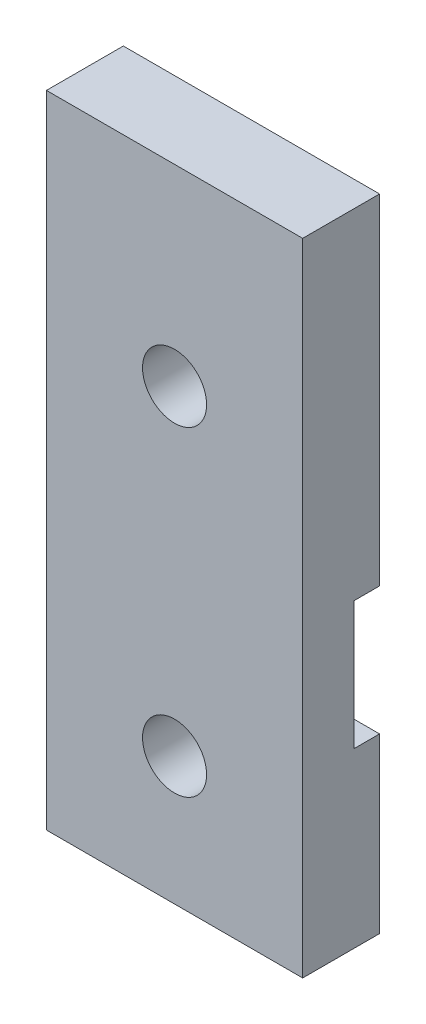
ISO-10303-21;
HEADER;
FILE_DESCRIPTION(('STEP AP214'),'2;1');
FILE_NAME('part.step','',(''),(''),'','','');
FILE_SCHEMA(('AUTOMOTIVE_DESIGN { 1 0 10303 214 1 1 1 1 }'));
ENDSEC;
DATA;
#1=APPLICATION_CONTEXT('core data for automotive mechanical design processes');
#2=APPLICATION_PROTOCOL_DEFINITION('international standard','automotive_design',2000,#1);
#3=PRODUCT_CONTEXT('',#1,'mechanical');
#4=PRODUCT('Part','Part','',(#3));
#5=PRODUCT_RELATED_PRODUCT_CATEGORY('part','',(#4));
#6=PRODUCT_DEFINITION_FORMATION('','',#4);
#7=PRODUCT_DEFINITION_CONTEXT('part definition',#1,'design');
#8=PRODUCT_DEFINITION('design','',#6,#7);
#9=PRODUCT_DEFINITION_SHAPE('','',#8);
#10=(LENGTH_UNIT() NAMED_UNIT(*) SI_UNIT(.MILLI.,.METRE.));
#11=(NAMED_UNIT(*) PLANE_ANGLE_UNIT() SI_UNIT($,.RADIAN.));
#12=(NAMED_UNIT(*) SI_UNIT($,.STERADIAN.) SOLID_ANGLE_UNIT());
#13=UNCERTAINTY_MEASURE_WITH_UNIT(LENGTH_MEASURE(1.E-05),#10,'distance_accuracy_value','');
#14=(GEOMETRIC_REPRESENTATION_CONTEXT(3) GLOBAL_UNCERTAINTY_ASSIGNED_CONTEXT((#13)) GLOBAL_UNIT_ASSIGNED_CONTEXT((#10,
#11,#12)) REPRESENTATION_CONTEXT('',''));
#15=CARTESIAN_POINT('',(0.,0.,0.));
#16=DIRECTION('',(0.,0.,1.));
#17=DIRECTION('',(1.,0.,0.));
#18=AXIS2_PLACEMENT_3D('',#15,#16,#17);
#19=CARTESIAN_POINT('',(3.25000000000008,18.5,2.));
#20=DIRECTION('',(0.,0.,-1.));
#21=DIRECTION('',(-1.,0.,0.));
#22=AXIS2_PLACEMENT_3D('',#19,#20,#21);
#23=CYLINDRICAL_SURFACE('',#22,5.);
#24=CARTESIAN_POINT('',(3.25000000000008,18.5,2.));
#25=DIRECTION('',(0.,0.,1.));
#26=DIRECTION('',(1.,0.,0.));
#27=AXIS2_PLACEMENT_3D('',#24,#25,#26);
#28=CIRCLE('',#27,5.);
#29=CARTESIAN_POINT('',(3.25000000000008,13.5,2.));
#30=VERTEX_POINT('',#29);
#31=CARTESIAN_POINT('',(3.25000000000008,23.5,2.));
#32=VERTEX_POINT('',#31);
#33=EDGE_CURVE('E142',#30,#32,#28,.T.);
#34=ORIENTED_EDGE('',*,*,#33,.T.);
#35=DIRECTION('',(0.,0.,-1.));
#36=VECTOR('',#35,1.);
#37=CARTESIAN_POINT('',(3.25000000000008,23.5,2.));
#38=LINE('',#37,#36);
#39=CARTESIAN_POINT('',(3.25000000000008,23.5,0.));
#40=VERTEX_POINT('',#39);
#41=EDGE_CURVE('E158',#32,#40,#38,.T.);
#42=ORIENTED_EDGE('',*,*,#41,.T.);
#43=CARTESIAN_POINT('',(3.25000000000008,18.5,0.));
#44=DIRECTION('',(0.,0.,1.));
#45=DIRECTION('',(1.,0.,0.));
#46=AXIS2_PLACEMENT_3D('',#43,#44,#45);
#47=CIRCLE('',#46,5.);
#48=CARTESIAN_POINT('',(3.25000000000008,13.5,0.));
#49=VERTEX_POINT('',#48);
#50=EDGE_CURVE('E144',#49,#40,#47,.T.);
#51=ORIENTED_EDGE('',*,*,#50,.F.);
#52=DIRECTION('',(0.,0.,-1.));
#53=VECTOR('',#52,1.);
#54=CARTESIAN_POINT('',(3.25000000000008,13.5,2.));
#55=LINE('',#54,#53);
#56=EDGE_CURVE('E132',#30,#49,#55,.T.);
#57=ORIENTED_EDGE('',*,*,#56,.F.);
#58=EDGE_LOOP('',(#34,#42,#51,#57));
#59=FACE_BOUND('',#58,.T.);
#60=ADVANCED_FACE('F39',(#59),#23,.F.);
#61=CARTESIAN_POINT('',(16.7499999999999,18.5,2.));
#62=DIRECTION('',(0.,0.,-1.));
#63=DIRECTION('',(-1.,0.,0.));
#64=AXIS2_PLACEMENT_3D('',#61,#62,#63);
#65=CYLINDRICAL_SURFACE('',#64,5.);
#66=DIRECTION('',(0.,0.,-1.));
#67=VECTOR('',#66,1.);
#68=CARTESIAN_POINT('',(16.7499999999999,23.5,2.));
#69=LINE('',#68,#67);
#70=CARTESIAN_POINT('',(16.7499999999999,23.5,2.));
#71=VERTEX_POINT('',#70);
#72=CARTESIAN_POINT('',(16.7499999999999,23.5,0.));
#73=VERTEX_POINT('',#72);
#74=EDGE_CURVE('E219',#71,#73,#69,.T.);
#75=ORIENTED_EDGE('',*,*,#74,.F.);
#76=CARTESIAN_POINT('',(16.7499999999999,18.5,2.));
#77=DIRECTION('',(0.,0.,1.));
#78=DIRECTION('',(-1.,0.,0.));
#79=AXIS2_PLACEMENT_3D('',#76,#77,#78);
#80=CIRCLE('',#79,5.);
#81=CARTESIAN_POINT('',(16.7499999999999,13.5,2.));
#82=VERTEX_POINT('',#81);
#83=EDGE_CURVE('E151',#71,#82,#80,.T.);
#84=ORIENTED_EDGE('',*,*,#83,.T.);
#85=DIRECTION('',(0.,0.,-1.));
#86=VECTOR('',#85,1.);
#87=CARTESIAN_POINT('',(16.7499999999999,13.5,2.));
#88=LINE('',#87,#86);
#89=CARTESIAN_POINT('',(16.7499999999999,13.5,0.));
#90=VERTEX_POINT('',#89);
#91=EDGE_CURVE('E220',#82,#90,#88,.T.);
#92=ORIENTED_EDGE('',*,*,#91,.T.);
#93=CARTESIAN_POINT('',(16.7499999999999,18.5,0.));
#94=DIRECTION('',(0.,0.,-1.));
#95=DIRECTION('',(-1.,0.,0.));
#96=AXIS2_PLACEMENT_3D('',#93,#94,#95);
#97=CIRCLE('',#96,5.);
#98=EDGE_CURVE('E47',#73,#90,#97,.F.);
#99=ORIENTED_EDGE('',*,*,#98,.F.);
#100=EDGE_LOOP('',(#75,#84,#92,#99));
#101=FACE_BOUND('',#100,.T.);
#102=ADVANCED_FACE('F218',(#101),#65,.F.);
#103=CARTESIAN_POINT('',(0.,0.,6.));
#104=DIRECTION('',(1.,0.,0.));
#105=DIRECTION('',(0.,0.,-1.));
#106=AXIS2_PLACEMENT_3D('',#103,#104,#105);
#107=PLANE('',#106);
#108=DIRECTION('',(0.,-1.,0.));
#109=VECTOR('',#108,1.);
#110=CARTESIAN_POINT('',(0.,0.,0.));
#111=LINE('',#110,#109);
#112=CARTESIAN_POINT('',(0.,50.,0.));
#113=VERTEX_POINT('',#112);
#114=CARTESIAN_POINT('',(0.,23.5,0.));
#115=VERTEX_POINT('',#114);
#116=EDGE_CURVE('E183',#113,#115,#111,.T.);
#117=ORIENTED_EDGE('',*,*,#116,.T.);
#118=DIRECTION('',(0.,0.,-1.));
#119=VECTOR('',#118,1.);
#120=CARTESIAN_POINT('',(0.,23.5,2.));
#121=LINE('',#120,#119);
#122=CARTESIAN_POINT('',(0.,23.5,2.));
#123=VERTEX_POINT('',#122);
#124=EDGE_CURVE('E235',#123,#115,#121,.T.);
#125=ORIENTED_EDGE('',*,*,#124,.F.);
#126=DIRECTION('',(0.,-1.,0.));
#127=VECTOR('',#126,1.);
#128=CARTESIAN_POINT('',(0.,0.,2.));
#129=LINE('',#128,#127);
#130=CARTESIAN_POINT('',(0.,13.5,2.));
#131=VERTEX_POINT('',#130);
#132=EDGE_CURVE('E147',#123,#131,#129,.T.);
#133=ORIENTED_EDGE('',*,*,#132,.T.);
#134=DIRECTION('',(0.,0.,-1.));
#135=VECTOR('',#134,1.);
#136=CARTESIAN_POINT('',(0.,13.5,2.));
#137=LINE('',#136,#135);
#138=CARTESIAN_POINT('',(0.,13.5,0.));
#139=VERTEX_POINT('',#138);
#140=EDGE_CURVE('E135',#131,#139,#137,.T.);
#141=ORIENTED_EDGE('',*,*,#140,.T.);
#142=CARTESIAN_POINT('',(0.,0.,0.));
#143=VERTEX_POINT('',#142);
#144=EDGE_CURVE('E171',#139,#143,#111,.T.);
#145=ORIENTED_EDGE('',*,*,#144,.T.);
#146=DIRECTION('',(0.,0.,-1.));
#147=VECTOR('',#146,1.);
#148=CARTESIAN_POINT('',(0.,0.,6.));
#149=LINE('',#148,#147);
#150=CARTESIAN_POINT('',(0.,0.,6.));
#151=VERTEX_POINT('',#150);
#152=EDGE_CURVE('E201',#151,#143,#149,.T.);
#153=ORIENTED_EDGE('',*,*,#152,.F.);
#154=DIRECTION('',(0.,-1.,0.));
#155=VECTOR('',#154,1.);
#156=CARTESIAN_POINT('',(0.,0.,6.));
#157=LINE('',#156,#155);
#158=CARTESIAN_POINT('',(0.,50.,6.));
#159=VERTEX_POINT('',#158);
#160=EDGE_CURVE('E172',#159,#151,#157,.T.);
#161=ORIENTED_EDGE('',*,*,#160,.F.);
#162=DIRECTION('',(0.,0.,-1.));
#163=VECTOR('',#162,1.);
#164=CARTESIAN_POINT('',(0.,50.,6.));
#165=LINE('',#164,#163);
#166=EDGE_CURVE('E182',#159,#113,#165,.T.);
#167=ORIENTED_EDGE('',*,*,#166,.T.);
#168=EDGE_LOOP('',(#117,#125,#133,#141,#145,#153,#161,#167));
#169=FACE_BOUND('',#168,.T.);
#170=ADVANCED_FACE('F41',(#169),#107,.F.);
#171=CARTESIAN_POINT('',(20.,0.,6.));
#172=DIRECTION('',(-1.,0.,0.));
#173=DIRECTION('',(0.,0.,1.));
#174=AXIS2_PLACEMENT_3D('',#171,#172,#173);
#175=PLANE('',#174);
#176=DIRECTION('',(0.,-1.,0.));
#177=VECTOR('',#176,1.);
#178=CARTESIAN_POINT('',(20.,0.,2.));
#179=LINE('',#178,#177);
#180=CARTESIAN_POINT('',(20.,23.5,2.));
#181=VERTEX_POINT('',#180);
#182=CARTESIAN_POINT('',(20.,13.5,2.));
#183=VERTEX_POINT('',#182);
#184=EDGE_CURVE('E11',#181,#183,#179,.T.);
#185=ORIENTED_EDGE('',*,*,#184,.F.);
#186=DIRECTION('',(0.,0.,-1.));
#187=VECTOR('',#186,1.);
#188=CARTESIAN_POINT('',(20.,23.5,2.));
#189=LINE('',#188,#187);
#190=CARTESIAN_POINT('',(20.,23.5,0.));
#191=VERTEX_POINT('',#190);
#192=EDGE_CURVE('E222',#181,#191,#189,.T.);
#193=ORIENTED_EDGE('',*,*,#192,.T.);
#194=DIRECTION('',(0.,1.,0.));
#195=VECTOR('',#194,1.);
#196=CARTESIAN_POINT('',(20.,0.,0.));
#197=LINE('',#196,#195);
#198=CARTESIAN_POINT('',(20.,50.,0.));
#199=VERTEX_POINT('',#198);
#200=EDGE_CURVE('E188',#191,#199,#197,.T.);
#201=ORIENTED_EDGE('',*,*,#200,.T.);
#202=DIRECTION('',(0.,0.,-1.));
#203=VECTOR('',#202,1.);
#204=CARTESIAN_POINT('',(20.,50.,6.));
#205=LINE('',#204,#203);
#206=CARTESIAN_POINT('',(20.,50.,6.));
#207=VERTEX_POINT('',#206);
#208=EDGE_CURVE('E195',#207,#199,#205,.T.);
#209=ORIENTED_EDGE('',*,*,#208,.F.);
#210=DIRECTION('',(0.,1.,0.));
#211=VECTOR('',#210,1.);
#212=CARTESIAN_POINT('',(20.,0.,6.));
#213=LINE('',#212,#211);
#214=CARTESIAN_POINT('',(20.,0.,6.));
#215=VERTEX_POINT('',#214);
#216=EDGE_CURVE('E178',#215,#207,#213,.T.);
#217=ORIENTED_EDGE('',*,*,#216,.F.);
#218=DIRECTION('',(0.,0.,-1.));
#219=VECTOR('',#218,1.);
#220=CARTESIAN_POINT('',(20.,0.,6.));
#221=LINE('',#220,#219);
#222=CARTESIAN_POINT('',(20.,0.,0.));
#223=VERTEX_POINT('',#222);
#224=EDGE_CURVE('E198',#215,#223,#221,.T.);
#225=ORIENTED_EDGE('',*,*,#224,.T.);
#226=CARTESIAN_POINT('',(20.,13.5,0.));
#227=VERTEX_POINT('',#226);
#228=EDGE_CURVE('E189',#223,#227,#197,.T.);
#229=ORIENTED_EDGE('',*,*,#228,.T.);
#230=DIRECTION('',(0.,0.,-1.));
#231=VECTOR('',#230,1.);
#232=CARTESIAN_POINT('',(20.,13.5,2.));
#233=LINE('',#232,#231);
#234=EDGE_CURVE('E154',#183,#227,#233,.T.);
#235=ORIENTED_EDGE('',*,*,#234,.F.);
#236=EDGE_LOOP('',(#185,#193,#201,#209,#217,#225,#229,#235));
#237=FACE_BOUND('',#236,.T.);
#238=ADVANCED_FACE('F296',(#237),#175,.F.);
#239=CARTESIAN_POINT('',(0.,0.,6.));
#240=DIRECTION('',(0.,1.,0.));
#241=DIRECTION('',(0.,0.,1.));
#242=AXIS2_PLACEMENT_3D('',#239,#240,#241);
#243=PLANE('',#242);
#244=DIRECTION('',(1.,0.,0.));
#245=VECTOR('',#244,1.);
#246=CARTESIAN_POINT('',(0.,0.,0.));
#247=LINE('',#246,#245);
#248=EDGE_CURVE('E186',#143,#223,#247,.T.);
#249=ORIENTED_EDGE('',*,*,#248,.T.);
#250=ORIENTED_EDGE('',*,*,#224,.F.);
#251=DIRECTION('',(1.,0.,0.));
#252=VECTOR('',#251,1.);
#253=CARTESIAN_POINT('',(0.,0.,6.));
#254=LINE('',#253,#252);
#255=EDGE_CURVE('E175',#151,#215,#254,.T.);
#256=ORIENTED_EDGE('',*,*,#255,.F.);
#257=ORIENTED_EDGE('',*,*,#152,.T.);
#258=EDGE_LOOP('',(#249,#250,#256,#257));
#259=FACE_BOUND('',#258,.T.);
#260=ADVANCED_FACE('F247',(#259),#243,.F.);
#261=CARTESIAN_POINT('',(0.,50.,6.));
#262=DIRECTION('',(0.,-1.,0.));
#263=DIRECTION('',(0.,0.,-1.));
#264=AXIS2_PLACEMENT_3D('',#261,#262,#263);
#265=PLANE('',#264);
#266=DIRECTION('',(-1.,0.,0.));
#267=VECTOR('',#266,1.);
#268=CARTESIAN_POINT('',(0.,50.,0.));
#269=LINE('',#268,#267);
#270=EDGE_CURVE('E176',#199,#113,#269,.T.);
#271=ORIENTED_EDGE('',*,*,#270,.T.);
#272=ORIENTED_EDGE('',*,*,#166,.F.);
#273=DIRECTION('',(-1.,0.,0.));
#274=VECTOR('',#273,1.);
#275=CARTESIAN_POINT('',(0.,50.,6.));
#276=LINE('',#275,#274);
#277=EDGE_CURVE('E180',#207,#159,#276,.T.);
#278=ORIENTED_EDGE('',*,*,#277,.F.);
#279=ORIENTED_EDGE('',*,*,#208,.T.);
#280=EDGE_LOOP('',(#271,#272,#278,#279));
#281=FACE_BOUND('',#280,.T.);
#282=ADVANCED_FACE('F257',(#281),#265,.F.);
#283=CARTESIAN_POINT('',(0.,0.,6.));
#284=DIRECTION('',(0.,0.,-1.));
#285=DIRECTION('',(-1.,0.,0.));
#286=AXIS2_PLACEMENT_3D('',#283,#284,#285);
#287=PLANE('',#286);
#288=CARTESIAN_POINT('',(10.0000000000083,34.9999999999969,6.));
#289=DIRECTION('',(0.,0.,-1.));
#290=DIRECTION('',(-1.,0.,0.));
#291=AXIS2_PLACEMENT_3D('',#288,#289,#290);
#292=CIRCLE('',#291,2.5);
#293=CARTESIAN_POINT('',(7.50000000000833,34.9999999999969,6.));
#294=VERTEX_POINT('',#293);
#295=EDGE_CURVE('E168',#294,#294,#292,.T.);
#296=ORIENTED_EDGE('',*,*,#295,.T.);
#297=EDGE_LOOP('',(#296));
#298=FACE_BOUND('',#297,.T.);
#299=CARTESIAN_POINT('',(10.0000000000083,10.,6.));
#300=DIRECTION('',(0.,0.,-1.));
#301=DIRECTION('',(-1.,0.,0.));
#302=AXIS2_PLACEMENT_3D('',#299,#300,#301);
#303=CIRCLE('',#302,2.5);
#304=CARTESIAN_POINT('',(7.50000000000832,10.,6.));
#305=VERTEX_POINT('',#304);
#306=EDGE_CURVE('E163',#305,#305,#303,.T.);
#307=ORIENTED_EDGE('',*,*,#306,.T.);
#308=EDGE_LOOP('',(#307));
#309=FACE_BOUND('',#308,.T.);
#310=ORIENTED_EDGE('',*,*,#160,.T.);
#311=ORIENTED_EDGE('',*,*,#255,.T.);
#312=ORIENTED_EDGE('',*,*,#216,.T.);
#313=ORIENTED_EDGE('',*,*,#277,.T.);
#314=EDGE_LOOP('',(#310,#311,#312,#313));
#315=FACE_BOUND('',#314,.T.);
#316=ADVANCED_FACE('F252',(#298,#309,#315),#287,.F.);
#317=CARTESIAN_POINT('',(0.,0.,0.));
#318=DIRECTION('',(0.,0.,-1.));
#319=DIRECTION('',(-1.,0.,0.));
#320=AXIS2_PLACEMENT_3D('',#317,#318,#319);
#321=PLANE('',#320);
#322=DIRECTION('',(1.,0.,0.));
#323=VECTOR('',#322,1.);
#324=CARTESIAN_POINT('',(3.25000000000008,23.5,0.));
#325=LINE('',#324,#323);
#326=EDGE_CURVE('E136',#115,#40,#325,.T.);
#327=ORIENTED_EDGE('',*,*,#326,.F.);
#328=ORIENTED_EDGE('',*,*,#116,.F.);
#329=ORIENTED_EDGE('',*,*,#270,.F.);
#330=ORIENTED_EDGE('',*,*,#200,.F.);
#331=DIRECTION('',(1.,0.,0.));
#332=VECTOR('',#331,1.);
#333=CARTESIAN_POINT('',(16.7499999999999,23.5,0.));
#334=LINE('',#333,#332);
#335=EDGE_CURVE('E214',#73,#191,#334,.T.);
#336=ORIENTED_EDGE('',*,*,#335,.F.);
#337=ORIENTED_EDGE('',*,*,#98,.T.);
#338=DIRECTION('',(-1.,0.,0.));
#339=VECTOR('',#338,1.);
#340=CARTESIAN_POINT('',(20.,13.5,0.));
#341=LINE('',#340,#339);
#342=EDGE_CURVE('E212',#227,#90,#341,.T.);
#343=ORIENTED_EDGE('',*,*,#342,.F.);
#344=ORIENTED_EDGE('',*,*,#228,.F.);
#345=ORIENTED_EDGE('',*,*,#248,.F.);
#346=ORIENTED_EDGE('',*,*,#144,.F.);
#347=DIRECTION('',(-1.,0.,0.));
#348=VECTOR('',#347,1.);
#349=CARTESIAN_POINT('',(0.,13.5,0.));
#350=LINE('',#349,#348);
#351=EDGE_CURVE('E228',#49,#139,#350,.T.);
#352=ORIENTED_EDGE('',*,*,#351,.F.);
#353=ORIENTED_EDGE('',*,*,#50,.T.);
#354=EDGE_LOOP('',(#327,#328,#329,#330,#336,#337,#343,#344,#345,#346,#352,#353));
#355=FACE_BOUND('',#354,.T.);
#356=CARTESIAN_POINT('',(10.0000000000083,34.9999999999969,0.));
#357=DIRECTION('',(0.,0.,-1.));
#358=DIRECTION('',(-1.,0.,0.));
#359=AXIS2_PLACEMENT_3D('',#356,#357,#358);
#360=CIRCLE('',#359,2.5);
#361=CARTESIAN_POINT('',(7.50000000000833,34.9999999999969,0.));
#362=VERTEX_POINT('',#361);
#363=EDGE_CURVE('E160',#362,#362,#360,.T.);
#364=ORIENTED_EDGE('',*,*,#363,.F.);
#365=EDGE_LOOP('',(#364));
#366=FACE_BOUND('',#365,.T.);
#367=CARTESIAN_POINT('',(10.0000000000083,10.,0.));
#368=DIRECTION('',(0.,0.,-1.));
#369=DIRECTION('',(-1.,0.,0.));
#370=AXIS2_PLACEMENT_3D('',#367,#368,#369);
#371=CIRCLE('',#370,2.5);
#372=CARTESIAN_POINT('',(7.50000000000832,10.,0.));
#373=VERTEX_POINT('',#372);
#374=EDGE_CURVE('E149',#373,#373,#371,.T.);
#375=ORIENTED_EDGE('',*,*,#374,.F.);
#376=EDGE_LOOP('',(#375));
#377=FACE_BOUND('',#376,.T.);
#378=ADVANCED_FACE('F209',(#355,#366,#377),#321,.T.);
#379=CARTESIAN_POINT('',(10.0000000000083,10.,10.));
#380=DIRECTION('',(0.,0.,-1.));
#381=DIRECTION('',(-1.,0.,0.));
#382=AXIS2_PLACEMENT_3D('',#379,#380,#381);
#383=CYLINDRICAL_SURFACE('',#382,2.5);
#384=ORIENTED_EDGE('',*,*,#374,.T.);
#385=EDGE_LOOP('',(#384));
#386=FACE_BOUND('',#385,.T.);
#387=ORIENTED_EDGE('',*,*,#306,.F.);
#388=EDGE_LOOP('',(#387));
#389=FACE_BOUND('',#388,.T.);
#390=ADVANCED_FACE('F284',(#386,#389),#383,.F.);
#391=CARTESIAN_POINT('',(10.0000000000083,34.9999999999969,10.));
#392=DIRECTION('',(0.,0.,-1.));
#393=DIRECTION('',(-1.,0.,0.));
#394=AXIS2_PLACEMENT_3D('',#391,#392,#393);
#395=CYLINDRICAL_SURFACE('',#394,2.5);
#396=ORIENTED_EDGE('',*,*,#363,.T.);
#397=EDGE_LOOP('',(#396));
#398=FACE_BOUND('',#397,.T.);
#399=ORIENTED_EDGE('',*,*,#295,.F.);
#400=EDGE_LOOP('',(#399));
#401=FACE_BOUND('',#400,.T.);
#402=ADVANCED_FACE('F281',(#398,#401),#395,.F.);
#403=CARTESIAN_POINT('',(3.25000000000008,18.5,2.));
#404=DIRECTION('',(0.,0.,1.));
#405=DIRECTION('',(1.,0.,0.));
#406=AXIS2_PLACEMENT_3D('',#403,#404,#405);
#407=PLANE('',#406);
#408=ORIENTED_EDGE('',*,*,#33,.F.);
#409=DIRECTION('',(-1.,0.,0.));
#410=VECTOR('',#409,1.);
#411=CARTESIAN_POINT('',(0.,13.5,2.));
#412=LINE('',#411,#410);
#413=EDGE_CURVE('E129',#30,#131,#412,.T.);
#414=ORIENTED_EDGE('',*,*,#413,.T.);
#415=ORIENTED_EDGE('',*,*,#132,.F.);
#416=DIRECTION('',(1.,0.,0.));
#417=VECTOR('',#416,1.);
#418=CARTESIAN_POINT('',(3.25000000000008,23.5,2.));
#419=LINE('',#418,#417);
#420=EDGE_CURVE('E54',#123,#32,#419,.T.);
#421=ORIENTED_EDGE('',*,*,#420,.T.);
#422=EDGE_LOOP('',(#408,#414,#415,#421));
#423=FACE_BOUND('',#422,.T.);
#424=ADVANCED_FACE('F146',(#423),#407,.F.);
#425=CARTESIAN_POINT('',(16.7499999999999,18.5,2.));
#426=DIRECTION('',(0.,0.,-1.));
#427=DIRECTION('',(-1.,0.,0.));
#428=AXIS2_PLACEMENT_3D('',#425,#426,#427);
#429=PLANE('',#428);
#430=ORIENTED_EDGE('',*,*,#83,.F.);
#431=DIRECTION('',(1.,0.,0.));
#432=VECTOR('',#431,1.);
#433=CARTESIAN_POINT('',(16.7499999999999,23.5,2.));
#434=LINE('',#433,#432);
#435=EDGE_CURVE('E224',#71,#181,#434,.T.);
#436=ORIENTED_EDGE('',*,*,#435,.T.);
#437=ORIENTED_EDGE('',*,*,#184,.T.);
#438=DIRECTION('',(-1.,0.,0.));
#439=VECTOR('',#438,1.);
#440=CARTESIAN_POINT('',(20.,13.5,2.));
#441=LINE('',#440,#439);
#442=EDGE_CURVE('E61',#183,#82,#441,.T.);
#443=ORIENTED_EDGE('',*,*,#442,.T.);
#444=EDGE_LOOP('',(#430,#436,#437,#443));
#445=FACE_BOUND('',#444,.T.);
#446=ADVANCED_FACE('F277',(#445),#429,.T.);
#447=CARTESIAN_POINT('',(20.,13.5,2.));
#448=DIRECTION('',(0.,-1.,0.));
#449=DIRECTION('',(0.,0.,-1.));
#450=AXIS2_PLACEMENT_3D('',#447,#448,#449);
#451=PLANE('',#450);
#452=ORIENTED_EDGE('',*,*,#342,.T.);
#453=ORIENTED_EDGE('',*,*,#91,.F.);
#454=ORIENTED_EDGE('',*,*,#442,.F.);
#455=ORIENTED_EDGE('',*,*,#234,.T.);
#456=EDGE_LOOP('',(#452,#453,#454,#455));
#457=FACE_BOUND('',#456,.T.);
#458=ADVANCED_FACE('F279',(#457),#451,.F.);
#459=CARTESIAN_POINT('',(16.7499999999999,23.5,2.));
#460=DIRECTION('',(0.,1.,0.));
#461=DIRECTION('',(0.,0.,1.));
#462=AXIS2_PLACEMENT_3D('',#459,#460,#461);
#463=PLANE('',#462);
#464=ORIENTED_EDGE('',*,*,#335,.T.);
#465=ORIENTED_EDGE('',*,*,#192,.F.);
#466=ORIENTED_EDGE('',*,*,#435,.F.);
#467=ORIENTED_EDGE('',*,*,#74,.T.);
#468=EDGE_LOOP('',(#464,#465,#466,#467));
#469=FACE_BOUND('',#468,.T.);
#470=ADVANCED_FACE('F266',(#469),#463,.F.);
#471=CARTESIAN_POINT('',(0.,13.5,2.));
#472=DIRECTION('',(0.,-1.,0.));
#473=DIRECTION('',(0.,0.,-1.));
#474=AXIS2_PLACEMENT_3D('',#471,#472,#473);
#475=PLANE('',#474);
#476=ORIENTED_EDGE('',*,*,#351,.T.);
#477=ORIENTED_EDGE('',*,*,#140,.F.);
#478=ORIENTED_EDGE('',*,*,#413,.F.);
#479=ORIENTED_EDGE('',*,*,#56,.T.);
#480=EDGE_LOOP('',(#476,#477,#478,#479));
#481=FACE_BOUND('',#480,.T.);
#482=ADVANCED_FACE('F131',(#481),#475,.F.);
#483=CARTESIAN_POINT('',(3.25000000000008,23.5,2.));
#484=DIRECTION('',(0.,1.,0.));
#485=DIRECTION('',(0.,0.,1.));
#486=AXIS2_PLACEMENT_3D('',#483,#484,#485);
#487=PLANE('',#486);
#488=ORIENTED_EDGE('',*,*,#326,.T.);
#489=ORIENTED_EDGE('',*,*,#41,.F.);
#490=ORIENTED_EDGE('',*,*,#420,.F.);
#491=ORIENTED_EDGE('',*,*,#124,.T.);
#492=EDGE_LOOP('',(#488,#489,#490,#491));
#493=FACE_BOUND('',#492,.T.);
#494=ADVANCED_FACE('F260',(#493),#487,.F.);
#495=CLOSED_SHELL('',(#60,#102,#170,#238,#260,#282,#316,#378,#390,#402,#424,#446,#458,#470,#482,#494));
#496=MANIFOLD_SOLID_BREP('B2',#495);
#497=ADVANCED_BREP_SHAPE_REPRESENTATION('',(#18,#496),#14);
#498=SHAPE_DEFINITION_REPRESENTATION(#9,#497);
ENDSEC;
END-ISO-10303-21;
